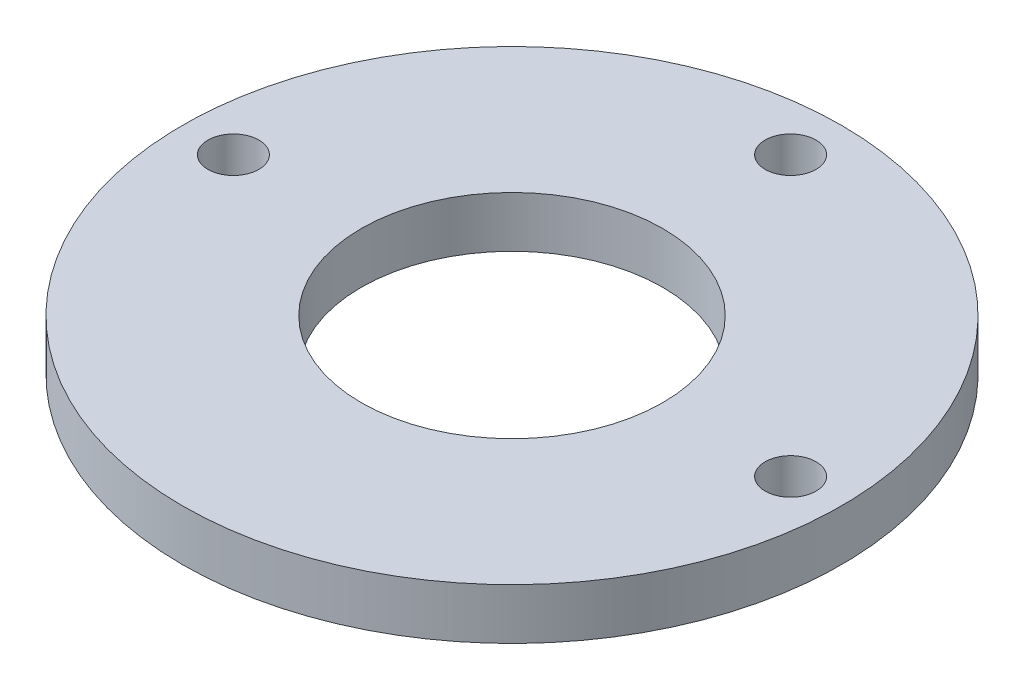
ISO-10303-21;
HEADER;
FILE_DESCRIPTION(('STEP AP214'),'2;1');
FILE_NAME('part.step','',(''),(''),'','','');
FILE_SCHEMA(('AUTOMOTIVE_DESIGN { 1 0 10303 214 1 1 1 1 }'));
ENDSEC;
DATA;
#1=APPLICATION_CONTEXT('core data for automotive mechanical design processes');
#2=APPLICATION_PROTOCOL_DEFINITION('international standard','automotive_design',2000,#1);
#3=PRODUCT_CONTEXT('',#1,'mechanical');
#4=PRODUCT('Part','Part','',(#3));
#5=PRODUCT_RELATED_PRODUCT_CATEGORY('part','',(#4));
#6=PRODUCT_DEFINITION_FORMATION('','',#4);
#7=PRODUCT_DEFINITION_CONTEXT('part definition',#1,'design');
#8=PRODUCT_DEFINITION('design','',#6,#7);
#9=PRODUCT_DEFINITION_SHAPE('','',#8);
#10=(LENGTH_UNIT() NAMED_UNIT(*) SI_UNIT(.MILLI.,.METRE.));
#11=(NAMED_UNIT(*) PLANE_ANGLE_UNIT() SI_UNIT($,.RADIAN.));
#12=(NAMED_UNIT(*) SI_UNIT($,.STERADIAN.) SOLID_ANGLE_UNIT());
#13=UNCERTAINTY_MEASURE_WITH_UNIT(LENGTH_MEASURE(1.E-05),#10,'distance_accuracy_value','');
#14=(GEOMETRIC_REPRESENTATION_CONTEXT(3) GLOBAL_UNCERTAINTY_ASSIGNED_CONTEXT((#13)) GLOBAL_UNIT_ASSIGNED_CONTEXT((#10,
#11,#12)) REPRESENTATION_CONTEXT('',''));
#15=CARTESIAN_POINT('',(0.,0.,0.));
#16=DIRECTION('',(0.,0.,1.));
#17=DIRECTION('',(1.,0.,0.));
#18=AXIS2_PLACEMENT_3D('',#15,#16,#17);
#19=CARTESIAN_POINT('',(0.,6.35,0.));
#20=DIRECTION('',(0.,-1.,0.));
#21=DIRECTION('',(0.,0.,-1.));
#22=AXIS2_PLACEMENT_3D('',#19,#20,#21);
#23=CYLINDRICAL_SURFACE('',#22,18.796);
#24=CARTESIAN_POINT('',(0.,6.35,0.));
#25=DIRECTION('',(0.,1.,0.));
#26=DIRECTION('',(0.,0.,1.));
#27=AXIS2_PLACEMENT_3D('',#24,#25,#26);
#28=CIRCLE('',#27,18.796);
#29=CARTESIAN_POINT('',(0.,6.35,18.796));
#30=VERTEX_POINT('',#29);
#31=EDGE_CURVE('E46',#30,#30,#28,.T.);
#32=ORIENTED_EDGE('',*,*,#31,.T.);
#33=EDGE_LOOP('',(#32));
#34=FACE_BOUND('',#33,.T.);
#35=CARTESIAN_POINT('',(0.,0.,0.));
#36=DIRECTION('',(0.,1.,0.));
#37=DIRECTION('',(0.,0.,1.));
#38=AXIS2_PLACEMENT_3D('',#35,#36,#37);
#39=CIRCLE('',#38,18.796);
#40=CARTESIAN_POINT('',(0.,0.,18.796));
#41=VERTEX_POINT('',#40);
#42=EDGE_CURVE('E63',#41,#41,#39,.T.);
#43=ORIENTED_EDGE('',*,*,#42,.F.);
#44=EDGE_LOOP('',(#43));
#45=FACE_BOUND('',#44,.T.);
#46=ADVANCED_FACE('F38',(#34,#45),#23,.F.);
#47=CARTESIAN_POINT('',(34.725,6.35,0.));
#48=DIRECTION('',(0.,-1.,0.));
#49=DIRECTION('',(0.,0.,-1.));
#50=AXIS2_PLACEMENT_3D('',#47,#48,#49);
#51=CYLINDRICAL_SURFACE('',#50,3.175);
#52=CARTESIAN_POINT('',(34.725,6.35,0.));
#53=DIRECTION('',(0.,1.,0.));
#54=DIRECTION('',(0.,0.,1.));
#55=AXIS2_PLACEMENT_3D('',#52,#53,#54);
#56=CIRCLE('',#55,3.175);
#57=CARTESIAN_POINT('',(34.725,6.35,3.175));
#58=VERTEX_POINT('',#57);
#59=EDGE_CURVE('E51',#58,#58,#56,.T.);
#60=ORIENTED_EDGE('',*,*,#59,.T.);
#61=EDGE_LOOP('',(#60));
#62=FACE_BOUND('',#61,.T.);
#63=CARTESIAN_POINT('',(34.725,0.,0.));
#64=DIRECTION('',(0.,1.,0.));
#65=DIRECTION('',(0.,0.,1.));
#66=AXIS2_PLACEMENT_3D('',#63,#64,#65);
#67=CIRCLE('',#66,3.175);
#68=CARTESIAN_POINT('',(34.725,0.,3.175));
#69=VERTEX_POINT('',#68);
#70=EDGE_CURVE('E61',#69,#69,#67,.T.);
#71=ORIENTED_EDGE('',*,*,#70,.F.);
#72=EDGE_LOOP('',(#71));
#73=FACE_BOUND('',#72,.T.);
#74=ADVANCED_FACE('F81',(#62,#73),#51,.F.);
#75=CARTESIAN_POINT('',(-34.725,6.35,0.));
#76=DIRECTION('',(0.,-1.,0.));
#77=DIRECTION('',(0.,0.,-1.));
#78=AXIS2_PLACEMENT_3D('',#75,#76,#77);
#79=CYLINDRICAL_SURFACE('',#78,3.175);
#80=CARTESIAN_POINT('',(-34.725,6.35,0.));
#81=DIRECTION('',(0.,1.,0.));
#82=DIRECTION('',(0.,0.,1.));
#83=AXIS2_PLACEMENT_3D('',#80,#81,#82);
#84=CIRCLE('',#83,3.175);
#85=CARTESIAN_POINT('',(-34.725,6.35,3.175));
#86=VERTEX_POINT('',#85);
#87=EDGE_CURVE('E72',#86,#86,#84,.T.);
#88=ORIENTED_EDGE('',*,*,#87,.T.);
#89=EDGE_LOOP('',(#88));
#90=FACE_BOUND('',#89,.T.);
#91=CARTESIAN_POINT('',(-34.725,0.,0.));
#92=DIRECTION('',(0.,1.,0.));
#93=DIRECTION('',(0.,0.,1.));
#94=AXIS2_PLACEMENT_3D('',#91,#92,#93);
#95=CIRCLE('',#94,3.175);
#96=CARTESIAN_POINT('',(-34.725,0.,3.175));
#97=VERTEX_POINT('',#96);
#98=EDGE_CURVE('E58',#97,#97,#95,.T.);
#99=ORIENTED_EDGE('',*,*,#98,.F.);
#100=EDGE_LOOP('',(#99));
#101=FACE_BOUND('',#100,.T.);
#102=ADVANCED_FACE('F99',(#90,#101),#79,.F.);
#103=CARTESIAN_POINT('',(0.,6.35,-34.725));
#104=DIRECTION('',(0.,-1.,0.));
#105=DIRECTION('',(0.,0.,-1.));
#106=AXIS2_PLACEMENT_3D('',#103,#104,#105);
#107=CYLINDRICAL_SURFACE('',#106,3.175);
#108=CARTESIAN_POINT('',(0.,6.35,-34.725));
#109=DIRECTION('',(0.,1.,0.));
#110=DIRECTION('',(0.,0.,1.));
#111=AXIS2_PLACEMENT_3D('',#108,#109,#110);
#112=CIRCLE('',#111,3.175);
#113=CARTESIAN_POINT('',(0.,6.35,-31.55));
#114=VERTEX_POINT('',#113);
#115=EDGE_CURVE('E68',#114,#114,#112,.T.);
#116=ORIENTED_EDGE('',*,*,#115,.T.);
#117=EDGE_LOOP('',(#116));
#118=FACE_BOUND('',#117,.T.);
#119=CARTESIAN_POINT('',(0.,0.,-34.725));
#120=DIRECTION('',(0.,1.,0.));
#121=DIRECTION('',(0.,0.,1.));
#122=AXIS2_PLACEMENT_3D('',#119,#120,#121);
#123=CIRCLE('',#122,3.175);
#124=CARTESIAN_POINT('',(0.,0.,-31.55));
#125=VERTEX_POINT('',#124);
#126=EDGE_CURVE('E55',#125,#125,#123,.T.);
#127=ORIENTED_EDGE('',*,*,#126,.F.);
#128=EDGE_LOOP('',(#127));
#129=FACE_BOUND('',#128,.T.);
#130=ADVANCED_FACE('F40',(#118,#129),#107,.F.);
#131=CARTESIAN_POINT('',(0.,6.35,0.));
#132=DIRECTION('',(0.,-1.,0.));
#133=DIRECTION('',(0.,0.,-1.));
#134=AXIS2_PLACEMENT_3D('',#131,#132,#133);
#135=CYLINDRICAL_SURFACE('',#134,41.075);
#136=CARTESIAN_POINT('',(0.,6.35,0.));
#137=DIRECTION('',(0.,1.,0.));
#138=DIRECTION('',(0.,0.,1.));
#139=AXIS2_PLACEMENT_3D('',#136,#137,#138);
#140=CIRCLE('',#139,41.075);
#141=CARTESIAN_POINT('',(0.,6.35,41.075));
#142=VERTEX_POINT('',#141);
#143=EDGE_CURVE('E10',#142,#142,#140,.T.);
#144=ORIENTED_EDGE('',*,*,#143,.F.);
#145=EDGE_LOOP('',(#144));
#146=FACE_BOUND('',#145,.T.);
#147=CARTESIAN_POINT('',(0.,0.,0.));
#148=DIRECTION('',(0.,1.,0.));
#149=DIRECTION('',(0.,0.,1.));
#150=AXIS2_PLACEMENT_3D('',#147,#148,#149);
#151=CIRCLE('',#150,41.075);
#152=CARTESIAN_POINT('',(0.,0.,41.075));
#153=VERTEX_POINT('',#152);
#154=EDGE_CURVE('E42',#153,#153,#151,.T.);
#155=ORIENTED_EDGE('',*,*,#154,.T.);
#156=EDGE_LOOP('',(#155));
#157=FACE_BOUND('',#156,.T.);
#158=ADVANCED_FACE('F88',(#146,#157),#135,.T.);
#159=CARTESIAN_POINT('',(0.,6.35,0.));
#160=DIRECTION('',(0.,1.,0.));
#161=DIRECTION('',(0.,0.,1.));
#162=AXIS2_PLACEMENT_3D('',#159,#160,#161);
#163=PLANE('',#162);
#164=ORIENTED_EDGE('',*,*,#115,.F.);
#165=EDGE_LOOP('',(#164));
#166=FACE_BOUND('',#165,.T.);
#167=ORIENTED_EDGE('',*,*,#87,.F.);
#168=EDGE_LOOP('',(#167));
#169=FACE_BOUND('',#168,.T.);
#170=ORIENTED_EDGE('',*,*,#59,.F.);
#171=EDGE_LOOP('',(#170));
#172=FACE_BOUND('',#171,.T.);
#173=ORIENTED_EDGE('',*,*,#31,.F.);
#174=EDGE_LOOP('',(#173));
#175=FACE_BOUND('',#174,.T.);
#176=ORIENTED_EDGE('',*,*,#143,.T.);
#177=EDGE_LOOP('',(#176));
#178=FACE_BOUND('',#177,.T.);
#179=ADVANCED_FACE('F84',(#166,#169,#172,#175,#178),#163,.T.);
#180=CARTESIAN_POINT('',(0.,0.,0.));
#181=DIRECTION('',(0.,1.,0.));
#182=DIRECTION('',(0.,0.,1.));
#183=AXIS2_PLACEMENT_3D('',#180,#181,#182);
#184=PLANE('',#183);
#185=ORIENTED_EDGE('',*,*,#126,.T.);
#186=EDGE_LOOP('',(#185));
#187=FACE_BOUND('',#186,.T.);
#188=ORIENTED_EDGE('',*,*,#98,.T.);
#189=EDGE_LOOP('',(#188));
#190=FACE_BOUND('',#189,.T.);
#191=ORIENTED_EDGE('',*,*,#70,.T.);
#192=EDGE_LOOP('',(#191));
#193=FACE_BOUND('',#192,.T.);
#194=ORIENTED_EDGE('',*,*,#42,.T.);
#195=EDGE_LOOP('',(#194));
#196=FACE_BOUND('',#195,.T.);
#197=ORIENTED_EDGE('',*,*,#154,.F.);
#198=EDGE_LOOP('',(#197));
#199=FACE_BOUND('',#198,.T.);
#200=ADVANCED_FACE('F87',(#187,#190,#193,#196,#199),#184,.F.);
#201=CLOSED_SHELL('',(#46,#74,#102,#130,#158,#179,#200));
#202=MANIFOLD_SOLID_BREP('B2',#201);
#203=ADVANCED_BREP_SHAPE_REPRESENTATION('',(#18,#202),#14);
#204=SHAPE_DEFINITION_REPRESENTATION(#9,#203);
ENDSEC;
END-ISO-10303-21;
